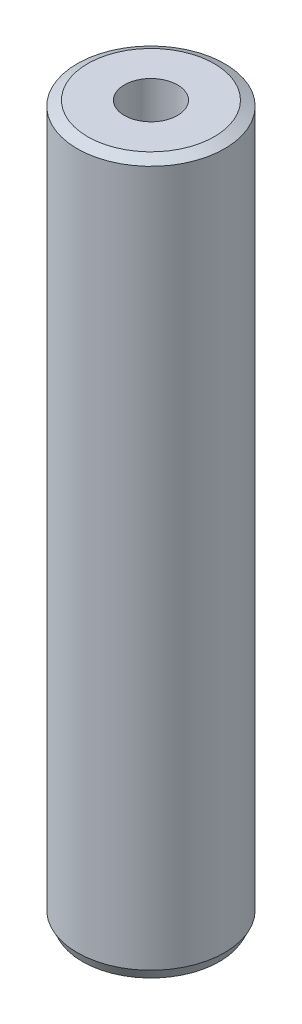
ISO-10303-21;
HEADER;
FILE_DESCRIPTION(('STEP AP214'),'2;1');
FILE_NAME('part.step','',(''),(''),'','','');
FILE_SCHEMA(('AUTOMOTIVE_DESIGN { 1 0 10303 214 1 1 1 1 }'));
ENDSEC;
DATA;
#1=APPLICATION_CONTEXT('core data for automotive mechanical design processes');
#2=APPLICATION_PROTOCOL_DEFINITION('international standard','automotive_design',2000,#1);
#3=PRODUCT_CONTEXT('',#1,'mechanical');
#4=PRODUCT('Part','Part','',(#3));
#5=PRODUCT_RELATED_PRODUCT_CATEGORY('part','',(#4));
#6=PRODUCT_DEFINITION_FORMATION('','',#4);
#7=PRODUCT_DEFINITION_CONTEXT('part definition',#1,'design');
#8=PRODUCT_DEFINITION('design','',#6,#7);
#9=PRODUCT_DEFINITION_SHAPE('','',#8);
#10=(LENGTH_UNIT() NAMED_UNIT(*) SI_UNIT(.MILLI.,.METRE.));
#11=(NAMED_UNIT(*) PLANE_ANGLE_UNIT() SI_UNIT($,.RADIAN.));
#12=(NAMED_UNIT(*) SI_UNIT($,.STERADIAN.) SOLID_ANGLE_UNIT());
#13=UNCERTAINTY_MEASURE_WITH_UNIT(LENGTH_MEASURE(1.E-05),#10,'distance_accuracy_value','');
#14=(GEOMETRIC_REPRESENTATION_CONTEXT(3) GLOBAL_UNCERTAINTY_ASSIGNED_CONTEXT((#13)) GLOBAL_UNIT_ASSIGNED_CONTEXT((#10,
#11,#12)) REPRESENTATION_CONTEXT('',''));
#15=CARTESIAN_POINT('',(0.,0.,0.));
#16=DIRECTION('',(0.,0.,1.));
#17=DIRECTION('',(1.,0.,0.));
#18=AXIS2_PLACEMENT_3D('',#15,#16,#17);
#19=CARTESIAN_POINT('',(0.,555.310233263066,0.));
#20=DIRECTION('',(0.,-1.,0.));
#21=DIRECTION('',(0.,0.,-1.));
#22=AXIS2_PLACEMENT_3D('',#19,#20,#21);
#23=CYLINDRICAL_SURFACE('',#22,57.5);
#24=CARTESIAN_POINT('',(0.,551.251258247049,0.));
#25=DIRECTION('',(0.,1.,0.));
#26=DIRECTION('',(0.,0.,1.));
#27=AXIS2_PLACEMENT_3D('',#24,#25,#26);
#28=CIRCLE('',#27,57.5);
#29=CARTESIAN_POINT('',(0.,551.251258247049,57.5));
#30=VERTEX_POINT('',#29);
#31=EDGE_CURVE('E50',#30,#30,#28,.F.);
#32=ORIENTED_EDGE('',*,*,#31,.T.);
#33=EDGE_LOOP('',(#32));
#34=FACE_BOUND('',#33,.T.);
#35=CARTESIAN_POINT('',(0.,8.10721410901549,0.));
#36=DIRECTION('',(0.,1.,0.));
#37=DIRECTION('',(0.,0.,1.));
#38=AXIS2_PLACEMENT_3D('',#35,#36,#37);
#39=CIRCLE('',#38,57.5);
#40=CARTESIAN_POINT('',(0.,8.10721410901549,57.5));
#41=VERTEX_POINT('',#40);
#42=EDGE_CURVE('E51',#41,#41,#39,.T.);
#43=ORIENTED_EDGE('',*,*,#42,.T.);
#44=EDGE_LOOP('',(#43));
#45=FACE_BOUND('',#44,.T.);
#46=ADVANCED_FACE('F39',(#34,#45),#23,.T.);
#47=CARTESIAN_POINT('',(0.,555.310233263066,0.));
#48=DIRECTION('',(0.,1.,0.));
#49=DIRECTION('',(0.,0.,1.));
#50=AXIS2_PLACEMENT_3D('',#47,#48,#49);
#51=PLANE('',#50);
#52=CARTESIAN_POINT('',(0.,555.310233263066,0.));
#53=DIRECTION('',(0.,1.,0.));
#54=DIRECTION('',(0.,0.,1.));
#55=AXIS2_PLACEMENT_3D('',#52,#53,#54);
#56=CIRCLE('',#55,49.3927858909851);
#57=CARTESIAN_POINT('',(0.,555.310233263066,49.3927858909851));
#58=VERTEX_POINT('',#57);
#59=EDGE_CURVE('E54',#58,#58,#56,.T.);
#60=ORIENTED_EDGE('',*,*,#59,.T.);
#61=EDGE_LOOP('',(#60));
#62=FACE_BOUND('',#61,.T.);
#63=CARTESIAN_POINT('',(0.,555.310233263066,0.));
#64=DIRECTION('',(0.,1.,0.));
#65=DIRECTION('',(0.,0.,1.));
#66=AXIS2_PLACEMENT_3D('',#63,#64,#65);
#67=CIRCLE('',#66,20.7203018023068);
#68=CARTESIAN_POINT('',(0.,555.310233263066,20.7203018023068));
#69=VERTEX_POINT('',#68);
#70=EDGE_CURVE('E58',#69,#69,#67,.T.);
#71=ORIENTED_EDGE('',*,*,#70,.F.);
#72=EDGE_LOOP('',(#71));
#73=FACE_BOUND('',#72,.T.);
#74=ADVANCED_FACE('F69',(#62,#73),#51,.T.);
#75=CARTESIAN_POINT('',(0.,0.,0.));
#76=DIRECTION('',(0.,1.,0.));
#77=DIRECTION('',(0.,0.,1.));
#78=AXIS2_PLACEMENT_3D('',#75,#76,#77);
#79=PLANE('',#78);
#80=CARTESIAN_POINT('',(0.,0.,0.));
#81=DIRECTION('',(0.,1.,0.));
#82=DIRECTION('',(0.,0.,1.));
#83=AXIS2_PLACEMENT_3D('',#80,#81,#82);
#84=CIRCLE('',#83,53.4410249839829);
#85=CARTESIAN_POINT('',(0.,0.,53.4410249839829));
#86=VERTEX_POINT('',#85);
#87=EDGE_CURVE('E10',#86,#86,#84,.F.);
#88=ORIENTED_EDGE('',*,*,#87,.T.);
#89=EDGE_LOOP('',(#88));
#90=FACE_BOUND('',#89,.T.);
#91=CARTESIAN_POINT('',(0.,0.,0.));
#92=DIRECTION('',(0.,1.,0.));
#93=DIRECTION('',(0.,0.,1.));
#94=AXIS2_PLACEMENT_3D('',#91,#92,#93);
#95=CIRCLE('',#94,20.7203018023068);
#96=CARTESIAN_POINT('',(0.,0.,20.7203018023068));
#97=VERTEX_POINT('',#96);
#98=EDGE_CURVE('E63',#97,#97,#95,.T.);
#99=ORIENTED_EDGE('',*,*,#98,.T.);
#100=EDGE_LOOP('',(#99));
#101=FACE_BOUND('',#100,.T.);
#102=ADVANCED_FACE('F75',(#90,#101),#79,.F.);
#103=CARTESIAN_POINT('',(0.,555.310233263066,0.));
#104=DIRECTION('',(0.,-1.,0.));
#105=DIRECTION('',(0.,0.,-1.));
#106=AXIS2_PLACEMENT_3D('',#103,#104,#105);
#107=CYLINDRICAL_SURFACE('',#106,20.7203018023068);
#108=ORIENTED_EDGE('',*,*,#70,.T.);
#109=EDGE_LOOP('',(#108));
#110=FACE_BOUND('',#109,.T.);
#111=ORIENTED_EDGE('',*,*,#98,.F.);
#112=EDGE_LOOP('',(#111));
#113=FACE_BOUND('',#112,.T.);
#114=ADVANCED_FACE('F70',(#110,#113),#107,.F.);
#115=CARTESIAN_POINT('',(0.,555.310233263066,0.));
#116=DIRECTION('',(0.,-1.,0.));
#117=DIRECTION('',(0.,0.,-1.));
#118=AXIS2_PLACEMENT_3D('',#115,#116,#117);
#119=CONICAL_SURFACE('',#118,49.3927858909851,1.10661916082276);
#120=ORIENTED_EDGE('',*,*,#31,.F.);
#121=EDGE_LOOP('',(#120));
#122=FACE_BOUND('',#121,.T.);
#123=ORIENTED_EDGE('',*,*,#59,.F.);
#124=EDGE_LOOP('',(#123));
#125=FACE_BOUND('',#124,.T.);
#126=ADVANCED_FACE('F81',(#122,#125),#119,.T.);
#127=CARTESIAN_POINT('',(0.,8.10721410901549,0.));
#128=DIRECTION('',(0.,1.,0.));
#129=DIRECTION('',(0.,0.,1.));
#130=AXIS2_PLACEMENT_3D('',#127,#128,#129);
#131=CONICAL_SURFACE('',#130,57.5,0.464177165972137);
#132=ORIENTED_EDGE('',*,*,#87,.F.);
#133=EDGE_LOOP('',(#132));
#134=FACE_BOUND('',#133,.T.);
#135=ORIENTED_EDGE('',*,*,#42,.F.);
#136=EDGE_LOOP('',(#135));
#137=FACE_BOUND('',#136,.T.);
#138=ADVANCED_FACE('F45',(#134,#137),#131,.T.);
#139=CLOSED_SHELL('',(#46,#74,#102,#114,#126,#138));
#140=MANIFOLD_SOLID_BREP('B2',#139);
#141=ADVANCED_BREP_SHAPE_REPRESENTATION('',(#18,#140),#14);
#142=SHAPE_DEFINITION_REPRESENTATION(#9,#141);
ENDSEC;
END-ISO-10303-21;
